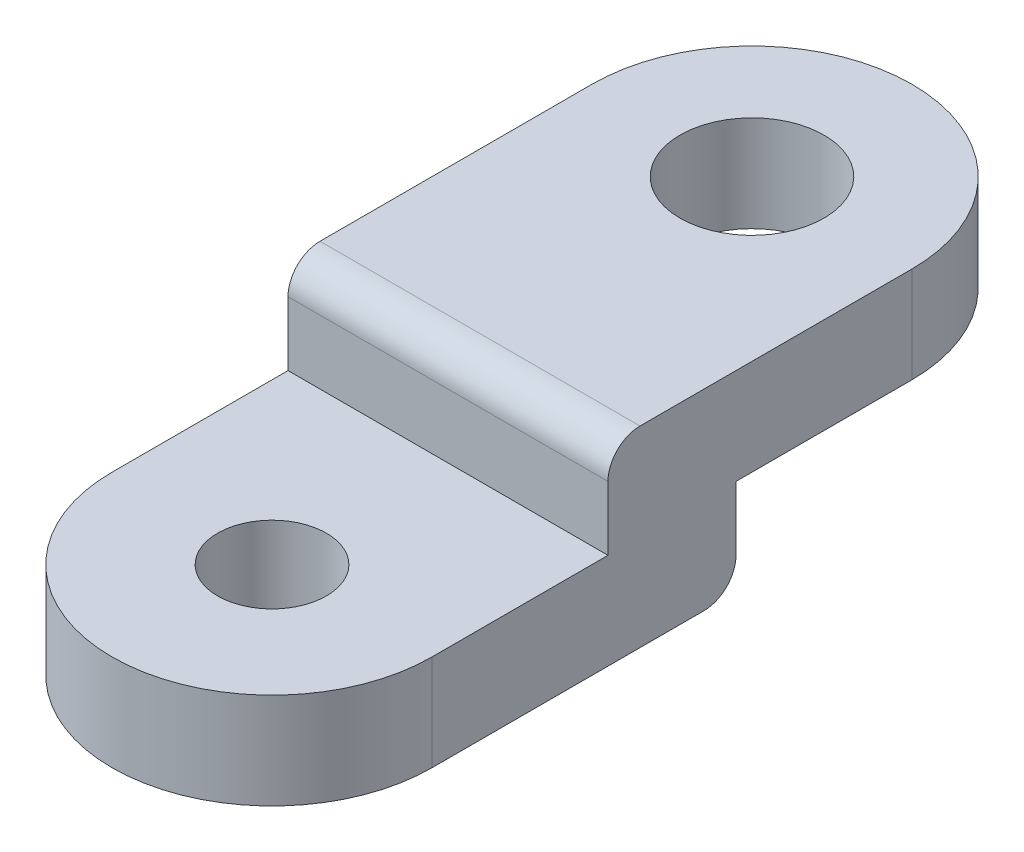
ISO-10303-21;
HEADER;
FILE_DESCRIPTION(('STEP AP214'),'2;1');
FILE_NAME('part.step','',(''),(''),'','','');
FILE_SCHEMA(('AUTOMOTIVE_DESIGN { 1 0 10303 214 1 1 1 1 }'));
ENDSEC;
DATA;
#1=APPLICATION_CONTEXT('core data for automotive mechanical design processes');
#2=APPLICATION_PROTOCOL_DEFINITION('international standard','automotive_design',2000,#1);
#3=PRODUCT_CONTEXT('',#1,'mechanical');
#4=PRODUCT('Part','Part','',(#3));
#5=PRODUCT_RELATED_PRODUCT_CATEGORY('part','',(#4));
#6=PRODUCT_DEFINITION_FORMATION('','',#4);
#7=PRODUCT_DEFINITION_CONTEXT('part definition',#1,'design');
#8=PRODUCT_DEFINITION('design','',#6,#7);
#9=PRODUCT_DEFINITION_SHAPE('','',#8);
#10=(LENGTH_UNIT() NAMED_UNIT(*) SI_UNIT(.MILLI.,.METRE.));
#11=(NAMED_UNIT(*) PLANE_ANGLE_UNIT() SI_UNIT($,.RADIAN.));
#12=(NAMED_UNIT(*) SI_UNIT($,.STERADIAN.) SOLID_ANGLE_UNIT());
#13=UNCERTAINTY_MEASURE_WITH_UNIT(LENGTH_MEASURE(1.E-05),#10,'distance_accuracy_value','');
#14=(GEOMETRIC_REPRESENTATION_CONTEXT(3) GLOBAL_UNCERTAINTY_ASSIGNED_CONTEXT((#13)) GLOBAL_UNIT_ASSIGNED_CONTEXT((#10,
#11,#12)) REPRESENTATION_CONTEXT('',''));
#15=CARTESIAN_POINT('',(0.,0.,0.));
#16=DIRECTION('',(0.,0.,1.));
#17=DIRECTION('',(1.,0.,0.));
#18=AXIS2_PLACEMENT_3D('',#15,#16,#17);
#19=CARTESIAN_POINT('',(10.,0.,0.));
#20=DIRECTION('',(0.,1.,0.));
#21=DIRECTION('',(0.,0.,1.));
#22=AXIS2_PLACEMENT_3D('',#19,#20,#21);
#23=PLANE('',#22);
#24=CARTESIAN_POINT('',(9.99999999999999,0.,-30.));
#25=DIRECTION('',(0.,1.,0.));
#26=DIRECTION('',(0.,0.,1.));
#27=AXIS2_PLACEMENT_3D('',#24,#25,#26);
#28=CIRCLE('',#27,4.5);
#29=CARTESIAN_POINT('',(9.99999999999999,0.,-25.5));
#30=VERTEX_POINT('',#29);
#31=EDGE_CURVE('E141',#30,#30,#28,.T.);
#32=ORIENTED_EDGE('',*,*,#31,.T.);
#33=EDGE_LOOP('',(#32));
#34=FACE_BOUND('',#33,.T.);
#35=CARTESIAN_POINT('',(9.99999999999999,0.,-30.));
#36=DIRECTION('',(0.,1.,0.));
#37=DIRECTION('',(0.,0.,1.));
#38=AXIS2_PLACEMENT_3D('',#35,#36,#37);
#39=CIRCLE('',#38,10.);
#40=CARTESIAN_POINT('',(20.,0.,-30.));
#41=VERTEX_POINT('',#40);
#42=CARTESIAN_POINT('',(0.,0.,-30.));
#43=VERTEX_POINT('',#42);
#44=EDGE_CURVE('E163',#41,#43,#39,.T.);
#45=ORIENTED_EDGE('',*,*,#44,.F.);
#46=DIRECTION('',(0.,0.,1.));
#47=VECTOR('',#46,1.);
#48=CARTESIAN_POINT('',(20.,0.,-30.));
#49=LINE('',#48,#47);
#50=CARTESIAN_POINT('',(20.,0.,-19.));
#51=VERTEX_POINT('',#50);
#52=EDGE_CURVE('E118',#41,#51,#49,.T.);
#53=ORIENTED_EDGE('',*,*,#52,.T.);
#54=DIRECTION('',(1.,0.,0.));
#55=VECTOR('',#54,1.);
#56=CARTESIAN_POINT('',(0.,0.,-19.));
#57=LINE('',#56,#55);
#58=CARTESIAN_POINT('',(0.,0.,-19.));
#59=VERTEX_POINT('',#58);
#60=EDGE_CURVE('E112',#59,#51,#57,.T.);
#61=ORIENTED_EDGE('',*,*,#60,.F.);
#62=DIRECTION('',(0.,0.,1.));
#63=VECTOR('',#62,1.);
#64=CARTESIAN_POINT('',(0.,0.,-30.));
#65=LINE('',#64,#63);
#66=EDGE_CURVE('E116',#43,#59,#65,.T.);
#67=ORIENTED_EDGE('',*,*,#66,.F.);
#68=EDGE_LOOP('',(#45,#53,#61,#67));
#69=FACE_BOUND('',#68,.T.);
#70=ADVANCED_FACE('F35',(#34,#69),#23,.F.);
#71=CARTESIAN_POINT('',(10.,6.,0.));
#72=DIRECTION('',(0.,-1.,0.));
#73=DIRECTION('',(0.,0.,-1.));
#74=AXIS2_PLACEMENT_3D('',#71,#72,#73);
#75=CYLINDRICAL_SURFACE('',#74,10.);
#76=CARTESIAN_POINT('',(10.,-6.,0.));
#77=DIRECTION('',(0.,1.,0.));
#78=DIRECTION('',(0.,0.,1.));
#79=AXIS2_PLACEMENT_3D('',#76,#77,#78);
#80=CIRCLE('',#79,10.);
#81=CARTESIAN_POINT('',(0.,-6.,0.));
#82=VERTEX_POINT('',#81);
#83=CARTESIAN_POINT('',(20.,-6.,0.));
#84=VERTEX_POINT('',#83);
#85=EDGE_CURVE('E160',#82,#84,#80,.T.);
#86=ORIENTED_EDGE('',*,*,#85,.T.);
#87=DIRECTION('',(0.,-1.,0.));
#88=VECTOR('',#87,1.);
#89=CARTESIAN_POINT('',(20.,6.,0.));
#90=LINE('',#89,#88);
#91=CARTESIAN_POINT('',(20.,0.,0.));
#92=VERTEX_POINT('',#91);
#93=EDGE_CURVE('E178',#92,#84,#90,.T.);
#94=ORIENTED_EDGE('',*,*,#93,.F.);
#95=CARTESIAN_POINT('',(10.,0.,0.));
#96=DIRECTION('',(0.,-1.,0.));
#97=DIRECTION('',(0.,0.,-1.));
#98=AXIS2_PLACEMENT_3D('',#95,#96,#97);
#99=CIRCLE('',#98,10.);
#100=CARTESIAN_POINT('',(0.,0.,0.));
#101=VERTEX_POINT('',#100);
#102=EDGE_CURVE('E158',#92,#101,#99,.T.);
#103=ORIENTED_EDGE('',*,*,#102,.T.);
#104=DIRECTION('',(0.,-1.,0.));
#105=VECTOR('',#104,1.);
#106=CARTESIAN_POINT('',(0.,6.,0.));
#107=LINE('',#106,#105);
#108=EDGE_CURVE('E170',#101,#82,#107,.T.);
#109=ORIENTED_EDGE('',*,*,#108,.T.);
#110=EDGE_LOOP('',(#86,#94,#103,#109));
#111=FACE_BOUND('',#110,.T.);
#112=ADVANCED_FACE('F212',(#111),#75,.T.);
#113=CARTESIAN_POINT('',(20.,6.,-30.));
#114=DIRECTION('',(-1.,0.,0.));
#115=DIRECTION('',(0.,0.,1.));
#116=AXIS2_PLACEMENT_3D('',#113,#114,#115);
#117=PLANE('',#116);
#118=DIRECTION('',(0.,0.,1.));
#119=VECTOR('',#118,1.);
#120=CARTESIAN_POINT('',(20.,-6.,-19.));
#121=LINE('',#120,#119);
#122=CARTESIAN_POINT('',(20.,-6.,-17.));
#123=VERTEX_POINT('',#122);
#124=EDGE_CURVE('E136',#123,#84,#121,.T.);
#125=ORIENTED_EDGE('',*,*,#124,.F.);
#126=CARTESIAN_POINT('',(20.,-4.,-17.));
#127=DIRECTION('',(-1.,0.,0.));
#128=DIRECTION('',(0.,0.,1.));
#129=AXIS2_PLACEMENT_3D('',#126,#127,#128);
#130=CIRCLE('',#129,2.);
#131=CARTESIAN_POINT('',(20.,-4.,-19.));
#132=VERTEX_POINT('',#131);
#133=EDGE_CURVE('E186',#123,#132,#130,.F.);
#134=ORIENTED_EDGE('',*,*,#133,.T.);
#135=DIRECTION('',(0.,-1.,0.));
#136=VECTOR('',#135,1.);
#137=CARTESIAN_POINT('',(20.,0.,-19.));
#138=LINE('',#137,#136);
#139=EDGE_CURVE('E138',#51,#132,#138,.T.);
#140=ORIENTED_EDGE('',*,*,#139,.F.);
#141=ORIENTED_EDGE('',*,*,#52,.F.);
#142=DIRECTION('',(0.,-1.,0.));
#143=VECTOR('',#142,1.);
#144=CARTESIAN_POINT('',(20.,6.,-30.));
#145=LINE('',#144,#143);
#146=CARTESIAN_POINT('',(20.,6.,-30.));
#147=VERTEX_POINT('',#146);
#148=EDGE_CURVE('E175',#147,#41,#145,.T.);
#149=ORIENTED_EDGE('',*,*,#148,.F.);
#150=DIRECTION('',(0.,0.,-1.));
#151=VECTOR('',#150,1.);
#152=CARTESIAN_POINT('',(20.,6.,-30.));
#153=LINE('',#152,#151);
#154=CARTESIAN_POINT('',(20.,6.,-13.));
#155=VERTEX_POINT('',#154);
#156=EDGE_CURVE('E164',#155,#147,#153,.T.);
#157=ORIENTED_EDGE('',*,*,#156,.F.);
#158=CARTESIAN_POINT('',(20.,4.,-13.));
#159=DIRECTION('',(-1.,0.,0.));
#160=DIRECTION('',(0.,0.,1.));
#161=AXIS2_PLACEMENT_3D('',#158,#159,#160);
#162=CIRCLE('',#161,2.);
#163=CARTESIAN_POINT('',(20.,4.,-11.));
#164=VERTEX_POINT('',#163);
#165=EDGE_CURVE('E184',#155,#164,#162,.F.);
#166=ORIENTED_EDGE('',*,*,#165,.T.);
#167=DIRECTION('',(0.,1.,0.));
#168=VECTOR('',#167,1.);
#169=CARTESIAN_POINT('',(20.,6.,-11.));
#170=LINE('',#169,#168);
#171=CARTESIAN_POINT('',(20.,0.,-11.));
#172=VERTEX_POINT('',#171);
#173=EDGE_CURVE('E151',#172,#164,#170,.T.);
#174=ORIENTED_EDGE('',*,*,#173,.F.);
#175=DIRECTION('',(0.,0.,-1.));
#176=VECTOR('',#175,1.);
#177=CARTESIAN_POINT('',(20.,0.,-11.));
#178=LINE('',#177,#176);
#179=EDGE_CURVE('E122',#92,#172,#178,.T.);
#180=ORIENTED_EDGE('',*,*,#179,.F.);
#181=ORIENTED_EDGE('',*,*,#93,.T.);
#182=EDGE_LOOP('',(#125,#134,#140,#141,#149,#157,#166,#174,#180,#181));
#183=FACE_BOUND('',#182,.T.);
#184=ADVANCED_FACE('F200',(#183),#117,.F.);
#185=CARTESIAN_POINT('',(9.99999999999999,6.,-30.));
#186=DIRECTION('',(0.,-1.,0.));
#187=DIRECTION('',(0.,0.,-1.));
#188=AXIS2_PLACEMENT_3D('',#185,#186,#187);
#189=CYLINDRICAL_SURFACE('',#188,10.);
#190=ORIENTED_EDGE('',*,*,#44,.T.);
#191=DIRECTION('',(0.,-1.,0.));
#192=VECTOR('',#191,1.);
#193=CARTESIAN_POINT('',(0.,6.,-30.));
#194=LINE('',#193,#192);
#195=CARTESIAN_POINT('',(0.,6.,-30.));
#196=VERTEX_POINT('',#195);
#197=EDGE_CURVE('E135',#196,#43,#194,.T.);
#198=ORIENTED_EDGE('',*,*,#197,.F.);
#199=CARTESIAN_POINT('',(9.99999999999999,6.,-30.));
#200=DIRECTION('',(0.,1.,0.));
#201=DIRECTION('',(0.,0.,1.));
#202=AXIS2_PLACEMENT_3D('',#199,#200,#201);
#203=CIRCLE('',#202,10.);
#204=EDGE_CURVE('E166',#147,#196,#203,.T.);
#205=ORIENTED_EDGE('',*,*,#204,.F.);
#206=ORIENTED_EDGE('',*,*,#148,.T.);
#207=EDGE_LOOP('',(#190,#198,#205,#206));
#208=FACE_BOUND('',#207,.T.);
#209=ADVANCED_FACE('F204',(#208),#189,.T.);
#210=CARTESIAN_POINT('',(0.,6.,0.));
#211=DIRECTION('',(1.,0.,0.));
#212=DIRECTION('',(0.,0.,-1.));
#213=AXIS2_PLACEMENT_3D('',#210,#211,#212);
#214=PLANE('',#213);
#215=DIRECTION('',(0.,-1.,0.));
#216=VECTOR('',#215,1.);
#217=CARTESIAN_POINT('',(0.,0.,-19.));
#218=LINE('',#217,#216);
#219=CARTESIAN_POINT('',(0.,-4.,-19.));
#220=VERTEX_POINT('',#219);
#221=EDGE_CURVE('E126',#59,#220,#218,.T.);
#222=ORIENTED_EDGE('',*,*,#221,.T.);
#223=CARTESIAN_POINT('',(0.,-4.,-17.));
#224=DIRECTION('',(1.,0.,0.));
#225=DIRECTION('',(0.,0.,-1.));
#226=AXIS2_PLACEMENT_3D('',#223,#224,#225);
#227=CIRCLE('',#226,2.);
#228=CARTESIAN_POINT('',(0.,-6.,-17.));
#229=VERTEX_POINT('',#228);
#230=EDGE_CURVE('E190',#220,#229,#227,.F.);
#231=ORIENTED_EDGE('',*,*,#230,.T.);
#232=DIRECTION('',(0.,0.,1.));
#233=VECTOR('',#232,1.);
#234=CARTESIAN_POINT('',(0.,-6.,-19.));
#235=LINE('',#234,#233);
#236=EDGE_CURVE('E123',#229,#82,#235,.T.);
#237=ORIENTED_EDGE('',*,*,#236,.T.);
#238=ORIENTED_EDGE('',*,*,#108,.F.);
#239=DIRECTION('',(0.,0.,-1.));
#240=VECTOR('',#239,1.);
#241=CARTESIAN_POINT('',(0.,0.,-11.));
#242=LINE('',#241,#240);
#243=CARTESIAN_POINT('',(0.,0.,-11.));
#244=VERTEX_POINT('',#243);
#245=EDGE_CURVE('E147',#101,#244,#242,.T.);
#246=ORIENTED_EDGE('',*,*,#245,.T.);
#247=DIRECTION('',(0.,1.,0.));
#248=VECTOR('',#247,1.);
#249=CARTESIAN_POINT('',(0.,6.,-11.));
#250=LINE('',#249,#248);
#251=CARTESIAN_POINT('',(0.,4.,-11.));
#252=VERTEX_POINT('',#251);
#253=EDGE_CURVE('E150',#244,#252,#250,.T.);
#254=ORIENTED_EDGE('',*,*,#253,.T.);
#255=CARTESIAN_POINT('',(0.,4.,-13.));
#256=DIRECTION('',(1.,0.,0.));
#257=DIRECTION('',(0.,0.,-1.));
#258=AXIS2_PLACEMENT_3D('',#255,#256,#257);
#259=CIRCLE('',#258,2.);
#260=CARTESIAN_POINT('',(0.,6.,-13.));
#261=VERTEX_POINT('',#260);
#262=EDGE_CURVE('E50',#252,#261,#259,.F.);
#263=ORIENTED_EDGE('',*,*,#262,.T.);
#264=DIRECTION('',(0.,0.,1.));
#265=VECTOR('',#264,1.);
#266=CARTESIAN_POINT('',(0.,6.,0.));
#267=LINE('',#266,#265);
#268=EDGE_CURVE('E168',#196,#261,#267,.T.);
#269=ORIENTED_EDGE('',*,*,#268,.F.);
#270=ORIENTED_EDGE('',*,*,#197,.T.);
#271=ORIENTED_EDGE('',*,*,#66,.T.);
#272=EDGE_LOOP('',(#222,#231,#237,#238,#246,#254,#263,#269,#270,#271));
#273=FACE_BOUND('',#272,.T.);
#274=ADVANCED_FACE('F133',(#273),#214,.F.);
#275=CARTESIAN_POINT('',(10.,6.,0.));
#276=DIRECTION('',(0.,1.,0.));
#277=DIRECTION('',(0.,0.,1.));
#278=AXIS2_PLACEMENT_3D('',#275,#276,#277);
#279=PLANE('',#278);
#280=CARTESIAN_POINT('',(9.99999999999999,6.,-30.));
#281=DIRECTION('',(0.,1.,0.));
#282=DIRECTION('',(0.,0.,1.));
#283=AXIS2_PLACEMENT_3D('',#280,#281,#282);
#284=CIRCLE('',#283,4.5);
#285=CARTESIAN_POINT('',(9.99999999999999,6.,-25.5));
#286=VERTEX_POINT('',#285);
#287=EDGE_CURVE('E260',#286,#286,#284,.T.);
#288=ORIENTED_EDGE('',*,*,#287,.F.);
#289=EDGE_LOOP('',(#288));
#290=FACE_BOUND('',#289,.T.);
#291=ORIENTED_EDGE('',*,*,#268,.T.);
#292=DIRECTION('',(1.,0.,0.));
#293=VECTOR('',#292,1.);
#294=CARTESIAN_POINT('',(20.,6.,-13.));
#295=LINE('',#294,#293);
#296=EDGE_CURVE('E43',#261,#155,#295,.T.);
#297=ORIENTED_EDGE('',*,*,#296,.T.);
#298=ORIENTED_EDGE('',*,*,#156,.T.);
#299=ORIENTED_EDGE('',*,*,#204,.T.);
#300=EDGE_LOOP('',(#291,#297,#298,#299));
#301=FACE_BOUND('',#300,.T.);
#302=ADVANCED_FACE('F195',(#290,#301),#279,.T.);
#303=CARTESIAN_POINT('',(0.,-6.,-19.));
#304=DIRECTION('',(0.,1.,0.));
#305=DIRECTION('',(0.,0.,1.));
#306=AXIS2_PLACEMENT_3D('',#303,#304,#305);
#307=PLANE('',#306);
#308=CARTESIAN_POINT('',(10.,-6.,0.));
#309=DIRECTION('',(0.,1.,0.));
#310=DIRECTION('',(0.,0.,1.));
#311=AXIS2_PLACEMENT_3D('',#308,#309,#310);
#312=CIRCLE('',#311,3.4);
#313=CARTESIAN_POINT('',(10.,-6.,3.4));
#314=VERTEX_POINT('',#313);
#315=EDGE_CURVE('E255',#314,#314,#312,.T.);
#316=ORIENTED_EDGE('',*,*,#315,.T.);
#317=EDGE_LOOP('',(#316));
#318=FACE_BOUND('',#317,.T.);
#319=ORIENTED_EDGE('',*,*,#236,.F.);
#320=DIRECTION('',(1.,0.,0.));
#321=VECTOR('',#320,1.);
#322=CARTESIAN_POINT('',(0.,-6.,-17.));
#323=LINE('',#322,#321);
#324=EDGE_CURVE('E181',#229,#123,#323,.T.);
#325=ORIENTED_EDGE('',*,*,#324,.T.);
#326=ORIENTED_EDGE('',*,*,#124,.T.);
#327=ORIENTED_EDGE('',*,*,#85,.F.);
#328=EDGE_LOOP('',(#319,#325,#326,#327));
#329=FACE_BOUND('',#328,.T.);
#330=ADVANCED_FACE('F226',(#318,#329),#307,.F.);
#331=CARTESIAN_POINT('',(0.,0.,-19.));
#332=DIRECTION('',(0.,0.,1.));
#333=DIRECTION('',(1.,0.,0.));
#334=AXIS2_PLACEMENT_3D('',#331,#332,#333);
#335=PLANE('',#334);
#336=ORIENTED_EDGE('',*,*,#139,.T.);
#337=DIRECTION('',(1.,0.,0.));
#338=VECTOR('',#337,1.);
#339=CARTESIAN_POINT('',(0.,-4.,-19.));
#340=LINE('',#339,#338);
#341=EDGE_CURVE('E129',#132,#220,#340,.F.);
#342=ORIENTED_EDGE('',*,*,#341,.T.);
#343=ORIENTED_EDGE('',*,*,#221,.F.);
#344=ORIENTED_EDGE('',*,*,#60,.T.);
#345=EDGE_LOOP('',(#336,#342,#343,#344));
#346=FACE_BOUND('',#345,.T.);
#347=ADVANCED_FACE('F127',(#346),#335,.F.);
#348=CARTESIAN_POINT('',(0.,0.,-11.));
#349=DIRECTION('',(0.,-1.,0.));
#350=DIRECTION('',(0.,0.,-1.));
#351=AXIS2_PLACEMENT_3D('',#348,#349,#350);
#352=PLANE('',#351);
#353=CARTESIAN_POINT('',(10.,0.,0.));
#354=DIRECTION('',(0.,1.,0.));
#355=DIRECTION('',(0.,0.,1.));
#356=AXIS2_PLACEMENT_3D('',#353,#354,#355);
#357=CIRCLE('',#356,3.4);
#358=CARTESIAN_POINT('',(10.,0.,3.4));
#359=VERTEX_POINT('',#358);
#360=EDGE_CURVE('E258',#359,#359,#357,.T.);
#361=ORIENTED_EDGE('',*,*,#360,.F.);
#362=EDGE_LOOP('',(#361));
#363=FACE_BOUND('',#362,.T.);
#364=ORIENTED_EDGE('',*,*,#179,.T.);
#365=DIRECTION('',(1.,0.,0.));
#366=VECTOR('',#365,1.);
#367=CARTESIAN_POINT('',(0.,0.,-11.));
#368=LINE('',#367,#366);
#369=EDGE_CURVE('E153',#244,#172,#368,.T.);
#370=ORIENTED_EDGE('',*,*,#369,.F.);
#371=ORIENTED_EDGE('',*,*,#245,.F.);
#372=ORIENTED_EDGE('',*,*,#102,.F.);
#373=EDGE_LOOP('',(#364,#370,#371,#372));
#374=FACE_BOUND('',#373,.T.);
#375=ADVANCED_FACE('F228',(#363,#374),#352,.F.);
#376=CARTESIAN_POINT('',(0.,6.,-11.));
#377=DIRECTION('',(0.,0.,-1.));
#378=DIRECTION('',(-1.,0.,0.));
#379=AXIS2_PLACEMENT_3D('',#376,#377,#378);
#380=PLANE('',#379);
#381=ORIENTED_EDGE('',*,*,#173,.T.);
#382=DIRECTION('',(1.,0.,0.));
#383=VECTOR('',#382,1.);
#384=CARTESIAN_POINT('',(0.,4.,-11.));
#385=LINE('',#384,#383);
#386=EDGE_CURVE('E11',#164,#252,#385,.F.);
#387=ORIENTED_EDGE('',*,*,#386,.T.);
#388=ORIENTED_EDGE('',*,*,#253,.F.);
#389=ORIENTED_EDGE('',*,*,#369,.T.);
#390=EDGE_LOOP('',(#381,#387,#388,#389));
#391=FACE_BOUND('',#390,.T.);
#392=ADVANCED_FACE('F231',(#391),#380,.F.);
#393=CARTESIAN_POINT('',(9.99999999999999,6.,-30.));
#394=DIRECTION('',(0.,1.,0.));
#395=DIRECTION('',(0.,0.,1.));
#396=AXIS2_PLACEMENT_3D('',#393,#394,#395);
#397=CYLINDRICAL_SURFACE('',#396,4.5);
#398=ORIENTED_EDGE('',*,*,#287,.T.);
#399=EDGE_LOOP('',(#398));
#400=FACE_BOUND('',#399,.T.);
#401=ORIENTED_EDGE('',*,*,#31,.F.);
#402=EDGE_LOOP('',(#401));
#403=FACE_BOUND('',#402,.T.);
#404=ADVANCED_FACE('F235',(#400,#403),#397,.F.);
#405=CARTESIAN_POINT('',(10.,0.,0.));
#406=DIRECTION('',(0.,1.,0.));
#407=DIRECTION('',(0.,0.,1.));
#408=AXIS2_PLACEMENT_3D('',#405,#406,#407);
#409=CYLINDRICAL_SURFACE('',#408,3.4);
#410=ORIENTED_EDGE('',*,*,#315,.F.);
#411=EDGE_LOOP('',(#410));
#412=FACE_BOUND('',#411,.T.);
#413=ORIENTED_EDGE('',*,*,#360,.T.);
#414=EDGE_LOOP('',(#413));
#415=FACE_BOUND('',#414,.T.);
#416=ADVANCED_FACE('F243',(#412,#415),#409,.F.);
#417=CARTESIAN_POINT('',(0.,-4.,-17.));
#418=DIRECTION('',(1.,0.,0.));
#419=DIRECTION('',(0.,0.,-1.));
#420=AXIS2_PLACEMENT_3D('',#417,#418,#419);
#421=CYLINDRICAL_SURFACE('',#420,2.);
#422=ORIENTED_EDGE('',*,*,#230,.F.);
#423=ORIENTED_EDGE('',*,*,#341,.F.);
#424=ORIENTED_EDGE('',*,*,#133,.F.);
#425=ORIENTED_EDGE('',*,*,#324,.F.);
#426=EDGE_LOOP('',(#422,#423,#424,#425));
#427=FACE_BOUND('',#426,.T.);
#428=ADVANCED_FACE('F246',(#427),#421,.T.);
#429=CARTESIAN_POINT('',(9.99999999999999,4.,-13.));
#430=DIRECTION('',(-1.,0.,0.));
#431=DIRECTION('',(0.,0.,1.));
#432=AXIS2_PLACEMENT_3D('',#429,#430,#431);
#433=CYLINDRICAL_SURFACE('',#432,2.);
#434=ORIENTED_EDGE('',*,*,#262,.F.);
#435=ORIENTED_EDGE('',*,*,#386,.F.);
#436=ORIENTED_EDGE('',*,*,#165,.F.);
#437=ORIENTED_EDGE('',*,*,#296,.F.);
#438=EDGE_LOOP('',(#434,#435,#436,#437));
#439=FACE_BOUND('',#438,.T.);
#440=ADVANCED_FACE('F37',(#439),#433,.T.);
#441=CLOSED_SHELL('',(#70,#112,#184,#209,#274,#302,#330,#347,#375,#392,#404,#416,#428,#440));
#442=MANIFOLD_SOLID_BREP('B2',#441);
#443=ADVANCED_BREP_SHAPE_REPRESENTATION('',(#18,#442),#14);
#444=SHAPE_DEFINITION_REPRESENTATION(#9,#443);
ENDSEC;
END-ISO-10303-21;
